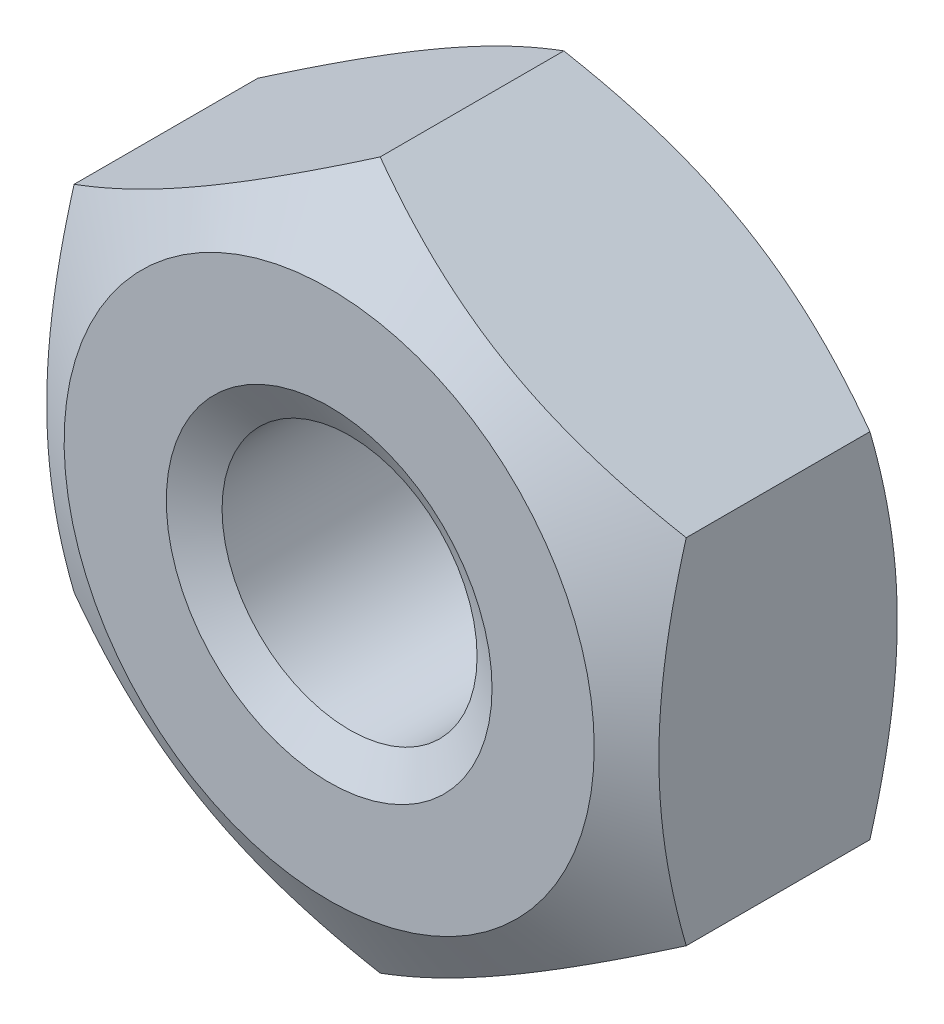
ISO-10303-21;
HEADER;
FILE_DESCRIPTION(('STEP AP214'),'2;1');
FILE_NAME('part.step','',(''),(''),'','','');
FILE_SCHEMA(('AUTOMOTIVE_DESIGN { 1 0 10303 214 1 1 1 1 }'));
ENDSEC;
DATA;
#1=APPLICATION_CONTEXT('core data for automotive mechanical design processes');
#2=APPLICATION_PROTOCOL_DEFINITION('international standard','automotive_design',2000,#1);
#3=PRODUCT_CONTEXT('',#1,'mechanical');
#4=PRODUCT('Part','Part','',(#3));
#5=PRODUCT_RELATED_PRODUCT_CATEGORY('part','',(#4));
#6=PRODUCT_DEFINITION_FORMATION('','',#4);
#7=PRODUCT_DEFINITION_CONTEXT('part definition',#1,'design');
#8=PRODUCT_DEFINITION('design','',#6,#7);
#9=PRODUCT_DEFINITION_SHAPE('','',#8);
#10=(LENGTH_UNIT() NAMED_UNIT(*) SI_UNIT(.MILLI.,.METRE.));
#11=(NAMED_UNIT(*) PLANE_ANGLE_UNIT() SI_UNIT($,.RADIAN.));
#12=(NAMED_UNIT(*) SI_UNIT($,.STERADIAN.) SOLID_ANGLE_UNIT());
#13=UNCERTAINTY_MEASURE_WITH_UNIT(LENGTH_MEASURE(1.E-05),#10,'distance_accuracy_value','');
#14=(GEOMETRIC_REPRESENTATION_CONTEXT(3) GLOBAL_UNCERTAINTY_ASSIGNED_CONTEXT((#13)) GLOBAL_UNIT_ASSIGNED_CONTEXT((#10,
#11,#12)) REPRESENTATION_CONTEXT('',''));
#15=CARTESIAN_POINT('',(0.,0.,0.));
#16=DIRECTION('',(0.,0.,1.));
#17=DIRECTION('',(1.,0.,0.));
#18=AXIS2_PLACEMENT_3D('',#15,#16,#17);
#19=CARTESIAN_POINT('',(1.49999999999999,0.866025403784457,-1.4));
#20=DIRECTION('',(0.499999999999995,0.866025403784442,0.));
#21=DIRECTION('',(-0.866025403784442,0.499999999999995,0.));
#22=AXIS2_PLACEMENT_3D('',#19,#20,#21);
#23=PLANE('',#22);
#24=CARTESIAN_POINT('',(-0.0002,1.73216627762272,-1.14993332666713));
#25=CARTESIAN_POINT('',(0.0657192911025475,1.69410775715987,-1.1719171434464));
#26=CARTESIAN_POINT('',(0.132207589122234,1.65572072040025,-1.19191111053375));
#27=CARTESIAN_POINT('',(0.266335660665069,1.57828184218911,-1.22681189903107));
#28=CARTESIAN_POINT('',(0.333977818646884,1.53922862406974,-1.24170637189241));
#29=CARTESIAN_POINT('',(0.46842377786984,1.46160621332091,-1.26489331890533));
#30=CARTESIAN_POINT('',(0.535206884927245,1.423048968484,-1.27334008850376));
#31=CARTESIAN_POINT('',(0.669087568389877,1.34575291984756,-1.28342642270372));
#32=CARTESIAN_POINT('',(0.736184657704374,1.30701439726999,-1.28507433685768));
#33=CARTESIAN_POINT('',(0.861574731829191,1.23462040422032,-1.28165837716247));
#34=CARTESIAN_POINT('',(0.919886423219814,1.20095413349904,-1.27743324099159));
#35=CARTESIAN_POINT('',(1.03612987953878,1.13384094270176,-1.2640382247829));
#36=CARTESIAN_POINT('',(1.09406124196878,1.10039425500828,-1.25486376259972));
#37=CARTESIAN_POINT('',(1.21054465133914,1.03314252725217,-1.23192681626058));
#38=CARTESIAN_POINT('',(1.26908194454668,0.999346005261166,-1.21806703805413));
#39=CARTESIAN_POINT('',(1.38528312338635,0.932257223377934,-1.18661021597892));
#40=CARTESIAN_POINT('',(1.4429484994038,0.898964103011338,-1.16902057032596));
#41=CARTESIAN_POINT('',(1.50019999999999,0.865909933730619,-1.14993332666712));
#42=B_SPLINE_CURVE_WITH_KNOTS('',3,(#24,#25,#26,#27,#28,#29,#30,#31,#32,#33,#34,#35,#36,#37,#38,
#39,#40,#41),.UNSPECIFIED.,.F.,.F.,(4,2,2,2,2,2,2,2,4),(0.,0.237777822177381,0.476127422841914,
0.708577067230583,0.940741159251571,1.14294352835889,1.34533342091874,1.55221450553905,
1.75868901573746),.UNSPECIFIED.);
#43=CARTESIAN_POINT('',(0.,1.73205080756891,-1.15));
#44=VERTEX_POINT('',#43);
#45=CARTESIAN_POINT('',(1.49999999999999,0.866025403784502,-1.15));
#46=VERTEX_POINT('',#45);
#47=EDGE_CURVE('E88',#44,#46,#42,.T.);
#48=ORIENTED_EDGE('',*,*,#47,.F.);
#49=DIRECTION('',(0.,0.,1.));
#50=VECTOR('',#49,1.);
#51=CARTESIAN_POINT('',(0.,1.73205080756888,-1.4));
#52=LINE('',#51,#50);
#53=CARTESIAN_POINT('',(0.,1.73205080756888,-0.249999999999983));
#54=VERTEX_POINT('',#53);
#55=EDGE_CURVE('E59',#44,#54,#52,.T.);
#56=ORIENTED_EDGE('',*,*,#55,.T.);
#57=CARTESIAN_POINT('',(1.50019999999999,0.865909933730619,-0.250066673332876));
#58=CARTESIAN_POINT('',(1.43428070889744,0.903968454193464,-0.228082856553604));
#59=CARTESIAN_POINT('',(1.36779241087776,0.94235549095309,-0.208088889466249));
#60=CARTESIAN_POINT('',(1.23366433933492,1.01979436916423,-0.173188100968934));
#61=CARTESIAN_POINT('',(1.16602218135311,1.0588475872836,-0.158293628107594));
#62=CARTESIAN_POINT('',(1.03157622213015,1.13646999803243,-0.13510668109467));
#63=CARTESIAN_POINT('',(0.964793115072744,1.17502724286934,-0.126659911496242));
#64=CARTESIAN_POINT('',(0.830912431610112,1.25232329150578,-0.11657357729628));
#65=CARTESIAN_POINT('',(0.763815342295614,1.29106181408335,-0.114925663142318));
#66=CARTESIAN_POINT('',(0.638425268170797,1.36345580713301,-0.118341622837532));
#67=CARTESIAN_POINT('',(0.580113576780174,1.39712207785429,-0.122566759008407));
#68=CARTESIAN_POINT('',(0.463870120461212,1.46423526865158,-0.135961775217097));
#69=CARTESIAN_POINT('',(0.40593875803121,1.49768195634506,-0.145136237400274));
#70=CARTESIAN_POINT('',(0.289455348660845,1.56493368410117,-0.168073183739419));
#71=CARTESIAN_POINT('',(0.230918055453306,1.59873020609217,-0.18193296194587));
#72=CARTESIAN_POINT('',(0.114716876613639,1.6658189879754,-0.213389784021079));
#73=CARTESIAN_POINT('',(0.0570515005961888,1.699112108342,-0.230979429674037));
#74=CARTESIAN_POINT('',(-0.000200000000000051,1.73216627762272,-0.250066673332872));
#75=B_SPLINE_CURVE_WITH_KNOTS('',3,(#57,#58,#59,#60,#61,#62,#63,#64,#65,#66,#67,#68,#69,#70,#71,
#72,#73,#74),.UNSPECIFIED.,.F.,.F.,(4,2,2,2,2,2,2,2,4),(0.,0.237777822177382,0.476127422841916,
0.708577067230586,0.940741159251575,1.1429435283589,1.34533342091874,1.55221450553906,
1.75868901573746),.UNSPECIFIED.);
#76=CARTESIAN_POINT('',(1.49999999999999,0.866025403784503,-0.250000000000001));
#77=VERTEX_POINT('',#76);
#78=EDGE_CURVE('E107',#77,#54,#75,.T.);
#79=ORIENTED_EDGE('',*,*,#78,.F.);
#80=DIRECTION('',(0.,0.,1.));
#81=VECTOR('',#80,1.);
#82=CARTESIAN_POINT('',(1.49999999999999,0.866025403784457,-1.4));
#83=LINE('',#82,#81);
#84=EDGE_CURVE('E102',#46,#77,#83,.T.);
#85=ORIENTED_EDGE('',*,*,#84,.F.);
#86=EDGE_LOOP('',(#48,#56,#79,#85));
#87=FACE_BOUND('',#86,.T.);
#88=ADVANCED_FACE('F36',(#87),#23,.T.);
#89=CARTESIAN_POINT('',(1.50000000000001,-0.866025403784425,-1.4));
#90=DIRECTION('',(1.,0.,0.));
#91=DIRECTION('',(0.,1.,0.));
#92=AXIS2_PLACEMENT_3D('',#89,#90,#91);
#93=PLANE('',#92);
#94=CARTESIAN_POINT('',(1.50000000000002,-2.2807732202783,-0.573936709991354));
#95=CARTESIAN_POINT('',(1.50000000000002,-2.2156210445045,-0.605355688611262));
#96=CARTESIAN_POINT('',(1.50000000000002,-2.15031443766187,-0.636459835310971));
#97=CARTESIAN_POINT('',(1.50000000000002,-2.01930971928559,-0.697860613483383));
#98=CARTESIAN_POINT('',(1.50000000000002,-1.95361154356196,-0.728157107839195));
#99=CARTESIAN_POINT('',(1.50000000000002,-1.82138019564906,-0.787927027536233));
#100=CARTESIAN_POINT('',(1.50000000000002,-1.75484439010186,-0.817394652365415));
#101=CARTESIAN_POINT('',(1.50000000000002,-1.62122834565648,-0.875060709663341));
#102=CARTESIAN_POINT('',(1.50000000000002,-1.5541481341152,-0.903259205446577));
#103=CARTESIAN_POINT('',(1.50000000000001,-1.41735947809199,-0.958855418055597));
#104=CARTESIAN_POINT('',(1.50000000000001,-1.34763149451046,-0.986205689933657));
#105=CARTESIAN_POINT('',(1.50000000000001,-1.20735758921427,-1.03871414886294));
#106=CARTESIAN_POINT('',(1.50000000000001,-1.13681156769636,-1.06387206518257));
#107=CARTESIAN_POINT('',(1.50000000000001,-0.924041890079284,-1.13503858358491));
#108=CARTESIAN_POINT('',(1.50000000000001,-0.780313873238381,-1.17689831926433));
#109=CARTESIAN_POINT('',(1.50000000000001,-0.562000170706209,-1.22598325326851));
#110=CARTESIAN_POINT('',(1.5,-0.488959664979743,-1.24004275995663));
#111=CARTESIAN_POINT('',(1.5,-0.342015881889071,-1.26268890937855));
#112=CARTESIAN_POINT('',(1.5,-0.268112672393984,-1.2712759797147));
#113=CARTESIAN_POINT('',(1.5,-0.120761318847337,-1.28218249719729));
#114=CARTESIAN_POINT('',(1.5,-0.0473190232916083,-1.28457890197161));
#115=CARTESIAN_POINT('',(1.5,0.099499947222512,-1.28310830408973));
#116=CARTESIAN_POINT('',(1.5,0.172876619612447,-1.27924106616445));
#117=CARTESIAN_POINT('',(1.5,0.351718709959219,-1.26252307145656));
#118=CARTESIAN_POINT('',(1.5,0.456882332290745,-1.24643200889295));
#119=CARTESIAN_POINT('',(1.49999999999999,0.665208255150202,-1.20432606342642));
#120=CARTESIAN_POINT('',(1.49999999999999,0.768368358943109,-1.17830086995822));
#121=CARTESIAN_POINT('',(1.49999999999999,0.974779816349307,-1.11848823761634));
#122=CARTESIAN_POINT('',(1.49999999999999,1.07798482551806,-1.08454499547237));
#123=CARTESIAN_POINT('',(1.49999999999999,1.28249024558448,-1.01153103776133));
#124=CARTESIAN_POINT('',(1.49999999999999,1.38379125789836,-0.972461973500144));
#125=CARTESIAN_POINT('',(1.49999999999998,1.61361087847929,-0.87913769567081));
#126=CARTESIAN_POINT('',(1.49999999999998,1.74165608940268,-0.823728333591492));
#127=CARTESIAN_POINT('',(1.49999999999998,1.99607108109679,-0.709167017777099));
#128=CARTESIAN_POINT('',(1.49999999999998,2.12244048864419,-0.650014246722006));
#129=CARTESIAN_POINT('',(1.49999999999998,2.37408263288399,-0.529156793090378));
#130=CARTESIAN_POINT('',(1.49999999999997,2.49935431836972,-0.467449932419216));
#131=CARTESIAN_POINT('',(1.49999999999997,2.7490285372206,-0.342300668721583));
#132=CARTESIAN_POINT('',(1.49999999999997,2.87343104481626,-0.278858214509837));
#133=CARTESIAN_POINT('',(1.49999999999997,3.11191628329182,-0.155724058607329));
#134=CARTESIAN_POINT('',(1.49999999999997,3.22604729837518,-0.0961256424446313));
#135=CARTESIAN_POINT('',(1.49999999999996,3.45389017740238,0.023873848457053));
#136=CARTESIAN_POINT('',(1.49999999999996,3.56760202928385,0.0842749460681989));
#137=CARTESIAN_POINT('',(1.49999999999996,3.79445292732096,0.205563584093104));
#138=CARTESIAN_POINT('',(1.49999999999996,3.90759267842518,0.266449807777674));
#139=CARTESIAN_POINT('',(1.49999999999996,4.13360183169341,0.388709427668254));
#140=CARTESIAN_POINT('',(1.49999999999996,4.24647124642338,0.45008280063484));
#141=CARTESIAN_POINT('',(1.49999999999995,4.3592399484054,0.511639402559556));
#142=B_SPLINE_CURVE_WITH_KNOTS('',3,(#94,#95,#96,#97,#98,#99,#100,#101,#102,#103,#104,#105,#106,
#107,#108,#109,#110,#111,#112,#113,#114,#115,#116,#117,#118,#119,#120,#121,#122,#123,#124,#125,
#126,#127,#128,#129,#130,#131,#132,#133,#134,#135,#136,#137,#138,#139,#140,#141),.UNSPECIFIED.,
.F.,.F.,(4,2,2,2,2,2,2,2,2,2,2,2,2,2,2,2,2,2,2,2,2,2,2,4),(0.,0.216999411713003,
0.434035432250143,0.65233165435681,0.870616973971527,1.0952779225467,1.31996657505736,
1.76813066937599,1.99111028787352,2.21407248117016,2.43424933896172,2.65443446702164,
2.97293806262893,3.29177313371924,3.61750854563506,3.94313927696458,4.36159863026302,
4.78014966554142,5.19906530242523,5.61799330711086,6.0042544493083,6.39052662159825,
6.77597262325083,7.16140034643672),.UNSPECIFIED.);
#143=CARTESIAN_POINT('',(1.50000000000002,-0.866025403784418,-1.15));
#144=VERTEX_POINT('',#143);
#145=EDGE_CURVE('E92',#46,#144,#142,.F.);
#146=ORIENTED_EDGE('',*,*,#145,.F.);
#147=ORIENTED_EDGE('',*,*,#84,.T.);
#148=CARTESIAN_POINT('',(1.50000000000002,-2.2807732202783,-0.826063290008646));
#149=CARTESIAN_POINT('',(1.50000000000002,-2.2156210445045,-0.794644311388738));
#150=CARTESIAN_POINT('',(1.50000000000002,-2.15031443766187,-0.763540164689029));
#151=CARTESIAN_POINT('',(1.50000000000002,-2.01930971928559,-0.702139386516617));
#152=CARTESIAN_POINT('',(1.50000000000002,-1.95361154356196,-0.671842892160805));
#153=CARTESIAN_POINT('',(1.50000000000002,-1.82138019564906,-0.612072972463766));
#154=CARTESIAN_POINT('',(1.50000000000002,-1.75484439010186,-0.582605347634585));
#155=CARTESIAN_POINT('',(1.50000000000002,-1.62122834565648,-0.524939290336658));
#156=CARTESIAN_POINT('',(1.50000000000002,-1.5541481341152,-0.496740794553423));
#157=CARTESIAN_POINT('',(1.50000000000001,-1.41735947809199,-0.441144581944403));
#158=CARTESIAN_POINT('',(1.50000000000001,-1.34763149451046,-0.413794310066342));
#159=CARTESIAN_POINT('',(1.50000000000001,-1.20735758921427,-0.361285851137064));
#160=CARTESIAN_POINT('',(1.50000000000001,-1.13681156769636,-0.336127934817426));
#161=CARTESIAN_POINT('',(1.50000000000001,-0.924041890079284,-0.26496141641509));
#162=CARTESIAN_POINT('',(1.50000000000001,-0.780313873238381,-0.223101680735669));
#163=CARTESIAN_POINT('',(1.50000000000001,-0.562000170706209,-0.174016746731492));
#164=CARTESIAN_POINT('',(1.5,-0.488959664979743,-0.159957240043373));
#165=CARTESIAN_POINT('',(1.5,-0.342015881889071,-0.137311090621454));
#166=CARTESIAN_POINT('',(1.5,-0.268112672393984,-0.128724020285304));
#167=CARTESIAN_POINT('',(1.5,-0.120761318847337,-0.117817502802706));
#168=CARTESIAN_POINT('',(1.5,-0.0473190232916082,-0.115421098028387));
#169=CARTESIAN_POINT('',(1.5,0.0994999472225122,-0.116891695910272));
#170=CARTESIAN_POINT('',(1.5,0.172876619612447,-0.120758933835546));
#171=CARTESIAN_POINT('',(1.5,0.351718709959219,-0.137476928543443));
#172=CARTESIAN_POINT('',(1.5,0.456882332290745,-0.153567991107053));
#173=CARTESIAN_POINT('',(1.49999999999999,0.665208255150202,-0.195673936573582));
#174=CARTESIAN_POINT('',(1.49999999999999,0.768368358943109,-0.221699130041783));
#175=CARTESIAN_POINT('',(1.49999999999999,0.974779816349306,-0.281511762383655));
#176=CARTESIAN_POINT('',(1.49999999999999,1.07798482551806,-0.315455004527625));
#177=CARTESIAN_POINT('',(1.49999999999999,1.28249024558448,-0.388468962238671));
#178=CARTESIAN_POINT('',(1.49999999999999,1.38379125789836,-0.427538026499856));
#179=CARTESIAN_POINT('',(1.49999999999998,1.61361087847929,-0.520862304329189));
#180=CARTESIAN_POINT('',(1.49999999999998,1.74165608940267,-0.576271666408507));
#181=CARTESIAN_POINT('',(1.49999999999998,1.99607108109679,-0.6908329822229));
#182=CARTESIAN_POINT('',(1.49999999999998,2.12244048864419,-0.749985753277993));
#183=CARTESIAN_POINT('',(1.49999999999998,2.37408263288399,-0.870843206909622));
#184=CARTESIAN_POINT('',(1.49999999999997,2.49935431836972,-0.932550067580784));
#185=CARTESIAN_POINT('',(1.49999999999997,2.7490285372206,-1.05769933127842));
#186=CARTESIAN_POINT('',(1.49999999999997,2.87343104481626,-1.12114178549016));
#187=CARTESIAN_POINT('',(1.49999999999997,3.11191628329182,-1.24427594139267));
#188=CARTESIAN_POINT('',(1.49999999999997,3.22604729837518,-1.30387435755537));
#189=CARTESIAN_POINT('',(1.49999999999996,3.45389017740238,-1.42387384845705));
#190=CARTESIAN_POINT('',(1.49999999999996,3.56760202928385,-1.4842749460682));
#191=CARTESIAN_POINT('',(1.49999999999996,3.79445292732096,-1.6055635840931));
#192=CARTESIAN_POINT('',(1.49999999999996,3.90759267842518,-1.66644980777767));
#193=CARTESIAN_POINT('',(1.49999999999996,4.13360183169341,-1.78870942766825));
#194=CARTESIAN_POINT('',(1.49999999999996,4.24647124642338,-1.85008280063484));
#195=CARTESIAN_POINT('',(1.49999999999995,4.3592399484054,-1.91163940255956));
#196=B_SPLINE_CURVE_WITH_KNOTS('',3,(#148,#149,#150,#151,#152,#153,#154,#155,#156,#157,#158,
#159,#160,#161,#162,#163,#164,#165,#166,#167,#168,#169,#170,#171,#172,#173,#174,#175,#176,#177,
#178,#179,#180,#181,#182,#183,#184,#185,#186,#187,#188,#189,#190,#191,#192,#193,#194,#195),
.UNSPECIFIED.,.F.,.F.,(4,2,2,2,2,2,2,2,2,2,2,2,2,2,2,2,2,2,2,2,2,2,2,4),(0.,0.216999411713004,
0.434035432250143,0.652331654356811,0.870616973971527,1.0952779225467,1.31996657505736,
1.76813066937599,1.99111028787352,2.21407248117016,2.43424933896172,2.65443446702164,
2.97293806262893,3.29177313371924,3.61750854563506,3.94313927696458,4.36159863026302,
4.78014966554141,5.19906530242523,5.61799330711086,6.0042544493083,6.39052662159825,
6.77597262325082,7.16140034643672),.UNSPECIFIED.);
#197=CARTESIAN_POINT('',(1.50000000000002,-0.866025403784418,-0.250000000000001));
#198=VERTEX_POINT('',#197);
#199=EDGE_CURVE('E124',#198,#77,#196,.T.);
#200=ORIENTED_EDGE('',*,*,#199,.F.);
#201=DIRECTION('',(0.,0.,1.));
#202=VECTOR('',#201,1.);
#203=CARTESIAN_POINT('',(1.50000000000001,-0.866025403784425,-1.4));
#204=LINE('',#203,#202);
#205=EDGE_CURVE('E104',#144,#198,#204,.T.);
#206=ORIENTED_EDGE('',*,*,#205,.F.);
#207=EDGE_LOOP('',(#146,#147,#200,#206));
#208=FACE_BOUND('',#207,.T.);
#209=ADVANCED_FACE('F100',(#208),#93,.T.);
#210=CARTESIAN_POINT('',(0.,-1.73205080756888,-1.4));
#211=DIRECTION('',(0.500000000000007,-0.866025403784435,0.));
#212=DIRECTION('',(0.866025403784435,0.500000000000007,0.));
#213=AXIS2_PLACEMENT_3D('',#210,#211,#212);
#214=PLANE('',#213);
#215=CARTESIAN_POINT('',(1.50020000000001,-0.865909933730588,-1.14993332666711));
#216=CARTESIAN_POINT('',(1.43428070889746,-0.903968454193433,-1.17191714344639));
#217=CARTESIAN_POINT('',(1.36779241087777,-0.942355490953061,-1.19191111053374));
#218=CARTESIAN_POINT('',(1.23366433933494,-1.0197943691642,-1.22681189903106));
#219=CARTESIAN_POINT('',(1.16602218135312,-1.05884758728357,-1.2417063718924));
#220=CARTESIAN_POINT('',(1.03157622213017,-1.13646999803241,-1.26489331890532));
#221=CARTESIAN_POINT('',(0.964793115072761,-1.17502724286932,-1.27334008850375));
#222=CARTESIAN_POINT('',(0.830912431610128,-1.25232329150576,-1.28342642270371));
#223=CARTESIAN_POINT('',(0.76381534229563,-1.29106181408333,-1.28507433685767));
#224=CARTESIAN_POINT('',(0.638425268170814,-1.363455807133,-1.28165837716246));
#225=CARTESIAN_POINT('',(0.58011357678019,-1.39712207785428,-1.27743324099158));
#226=CARTESIAN_POINT('',(0.463870120461227,-1.46423526865157,-1.26403822478289));
#227=CARTESIAN_POINT('',(0.405938758031224,-1.49768195634505,-1.25486376259971));
#228=CARTESIAN_POINT('',(0.289455348660859,-1.56493368410116,-1.23192681626056));
#229=CARTESIAN_POINT('',(0.230918055453319,-1.59873020609216,-1.21806703805411));
#230=CARTESIAN_POINT('',(0.114716876613652,-1.6658189879754,-1.1866102159789));
#231=CARTESIAN_POINT('',(0.0570515005962014,-1.699112108342,-1.16902057032594));
#232=CARTESIAN_POINT('',(-0.000199999999987768,-1.73216627762272,-1.14993332666711));
#233=B_SPLINE_CURVE_WITH_KNOTS('',3,(#215,#216,#217,#218,#219,#220,#221,#222,#223,#224,#225,
#226,#227,#228,#229,#230,#231,#232),.UNSPECIFIED.,.F.,.F.,(4,2,2,2,2,2,2,2,4),(0.,
0.237777822177385,0.476127422841921,0.708577067230593,0.940741159251584,1.14294352835891,
1.34533342091876,1.55221450553907,1.75868901573748),.UNSPECIFIED.);
#234=CARTESIAN_POINT('',(0.,-1.73205080756888,-1.15));
#235=VERTEX_POINT('',#234);
#236=EDGE_CURVE('E105',#144,#235,#233,.T.);
#237=ORIENTED_EDGE('',*,*,#236,.F.);
#238=ORIENTED_EDGE('',*,*,#205,.T.);
#239=CARTESIAN_POINT('',(-0.000199999999987872,-1.73216627762272,-0.25006667333289));
#240=CARTESIAN_POINT('',(0.0657192911025599,-1.69410775715987,-0.228082856553617));
#241=CARTESIAN_POINT('',(0.132207589122248,-1.65572072040024,-0.208088889466262));
#242=CARTESIAN_POINT('',(0.266335660665083,-1.5782818421891,-0.173188100968946));
#243=CARTESIAN_POINT('',(0.333977818646899,-1.53922862406973,-0.158293628107606));
#244=CARTESIAN_POINT('',(0.468423777869857,-1.4616062133209,-0.135106681094683));
#245=CARTESIAN_POINT('',(0.535206884927262,-1.42304896848398,-0.126659911496254));
#246=CARTESIAN_POINT('',(0.669087568389895,-1.34575291984754,-0.116573577296292));
#247=CARTESIAN_POINT('',(0.736184657704393,-1.30701439726997,-0.11492566314233));
#248=CARTESIAN_POINT('',(0.86157473182921,-1.2346204042203,-0.118341622837544));
#249=CARTESIAN_POINT('',(0.919886423219833,-1.20095413349902,-0.122566759008419));
#250=CARTESIAN_POINT('',(1.0361298795388,-1.13384094270174,-0.13596177521711));
#251=CARTESIAN_POINT('',(1.0940612419688,-1.10039425500825,-0.145136237400286));
#252=CARTESIAN_POINT('',(1.21054465133916,-1.03314252725214,-0.168073183739432));
#253=CARTESIAN_POINT('',(1.2690819445467,-0.999346005261139,-0.181932961945883));
#254=CARTESIAN_POINT('',(1.38528312338637,-0.932257223377904,-0.213389784021092));
#255=CARTESIAN_POINT('',(1.44294849940382,-0.898964103011308,-0.23097942967405));
#256=CARTESIAN_POINT('',(1.50020000000001,-0.865909933730588,-0.250066673332885));
#257=B_SPLINE_CURVE_WITH_KNOTS('',3,(#239,#240,#241,#242,#243,#244,#245,#246,#247,#248,#249,
#250,#251,#252,#253,#254,#255,#256),.UNSPECIFIED.,.F.,.F.,(4,2,2,2,2,2,2,2,4),(0.,
0.237777822177385,0.476127422841923,0.708577067230596,0.940741159251588,1.14294352835891,
1.34533342091876,1.55221450553907,1.75868901573748),.UNSPECIFIED.);
#258=CARTESIAN_POINT('',(0.,-1.73205080756888,-0.250000000000001));
#259=VERTEX_POINT('',#258);
#260=EDGE_CURVE('E128',#259,#198,#257,.T.);
#261=ORIENTED_EDGE('',*,*,#260,.F.);
#262=DIRECTION('',(0.,0.,1.));
#263=VECTOR('',#262,1.);
#264=CARTESIAN_POINT('',(0.,-1.73205080756888,-1.4));
#265=LINE('',#264,#263);
#266=EDGE_CURVE('E110',#235,#259,#265,.T.);
#267=ORIENTED_EDGE('',*,*,#266,.F.);
#268=EDGE_LOOP('',(#237,#238,#261,#267));
#269=FACE_BOUND('',#268,.T.);
#270=ADVANCED_FACE('F180',(#269),#214,.T.);
#271=CARTESIAN_POINT('',(-1.5,-0.866025403784446,-1.4));
#272=DIRECTION('',(-0.499999999999995,-0.866025403784442,0.));
#273=DIRECTION('',(0.866025403784441,-0.499999999999995,0.));
#274=AXIS2_PLACEMENT_3D('',#271,#272,#273);
#275=PLANE('',#274);
#276=CARTESIAN_POINT('',(0.000200000000012162,-1.73216627762272,-1.14993332666711));
#277=CARTESIAN_POINT('',(-0.0657192911025362,-1.69410775715987,-1.17191714344638));
#278=CARTESIAN_POINT('',(-0.132207589122224,-1.65572072040024,-1.19191111053374));
#279=CARTESIAN_POINT('',(-0.266335660665061,-1.5782818421891,-1.22681189903105));
#280=CARTESIAN_POINT('',(-0.333977818646878,-1.53922862406974,-1.24170637189239));
#281=CARTESIAN_POINT('',(-0.468423777869836,-1.4616062133209,-1.26489331890532));
#282=CARTESIAN_POINT('',(-0.535206884927242,-1.42304896848399,-1.27334008850375));
#283=CARTESIAN_POINT('',(-0.669087568389876,-1.34575291984755,-1.28342642270371));
#284=CARTESIAN_POINT('',(-0.736184657704375,-1.30701439726998,-1.28507433685767));
#285=CARTESIAN_POINT('',(-0.861574731829193,-1.23462040422031,-1.28165837716246));
#286=CARTESIAN_POINT('',(-0.919886423219817,-1.20095413349904,-1.27743324099158));
#287=CARTESIAN_POINT('',(-1.03612987953878,-1.13384094270175,-1.26403822478289));
#288=CARTESIAN_POINT('',(-1.09406124196878,-1.10039425500827,-1.25486376259971));
#289=CARTESIAN_POINT('',(-1.21054465133915,-1.03314252725216,-1.23192681626057));
#290=CARTESIAN_POINT('',(-1.26908194454669,-0.999346005261157,-1.21806703805412));
#291=CARTESIAN_POINT('',(-1.38528312338636,-0.932257223377923,-1.18661021597891));
#292=CARTESIAN_POINT('',(-1.44294849940381,-0.898964103011328,-1.16902057032595));
#293=CARTESIAN_POINT('',(-1.5002,-0.865909933730608,-1.14993332666711));
#294=B_SPLINE_CURVE_WITH_KNOTS('',3,(#276,#277,#278,#279,#280,#281,#282,#283,#284,#285,#286,
#287,#288,#289,#290,#291,#292,#293),.UNSPECIFIED.,.F.,.F.,(4,2,2,2,2,2,2,2,4),(0.,
0.237777822177385,0.476127422841922,0.708577067230595,0.940741159251588,1.14294352835891,
1.34533342091876,1.55221450553907,1.75868901573748),.UNSPECIFIED.);
#295=CARTESIAN_POINT('',(-1.5,-0.86602540378446,-1.15));
#296=VERTEX_POINT('',#295);
#297=EDGE_CURVE('E186',#235,#296,#294,.T.);
#298=ORIENTED_EDGE('',*,*,#297,.F.);
#299=ORIENTED_EDGE('',*,*,#266,.T.);
#300=CARTESIAN_POINT('',(-1.5002,-0.865909933730608,-0.250066673332885));
#301=CARTESIAN_POINT('',(-1.43428070889745,-0.903968454193453,-0.228082856553613));
#302=CARTESIAN_POINT('',(-1.36779241087776,-0.94235549095308,-0.208088889466258));
#303=CARTESIAN_POINT('',(-1.23366433933492,-1.01979436916422,-0.173188100968943));
#304=CARTESIAN_POINT('',(-1.16602218135311,-1.05884758728359,-0.158293628107604));
#305=CARTESIAN_POINT('',(-1.03157622213015,-1.13646999803242,-0.135106681094681));
#306=CARTESIAN_POINT('',(-0.964793115072745,-1.17502724286933,-0.126659911496253));
#307=CARTESIAN_POINT('',(-0.830912431610111,-1.25232329150577,-0.116573577296292));
#308=CARTESIAN_POINT('',(-0.763815342295612,-1.29106181408334,-0.11492566314233));
#309=CARTESIAN_POINT('',(-0.638425268170795,-1.36345580713301,-0.118341622837544));
#310=CARTESIAN_POINT('',(-0.58011357678017,-1.39712207785429,-0.12256675900842));
#311=CARTESIAN_POINT('',(-0.463870120461207,-1.46423526865157,-0.135961775217111));
#312=CARTESIAN_POINT('',(-0.405938758031203,-1.49768195634506,-0.145136237400288));
#313=CARTESIAN_POINT('',(-0.289455348660837,-1.56493368410116,-0.168073183739435));
#314=CARTESIAN_POINT('',(-0.230918055453297,-1.59873020609217,-0.181932961945886));
#315=CARTESIAN_POINT('',(-0.114716876613628,-1.6658189879754,-0.213389784021096));
#316=CARTESIAN_POINT('',(-0.0570515005961773,-1.699112108342,-0.230979429674055));
#317=CARTESIAN_POINT('',(0.000200000000012196,-1.73216627762272,-0.25006667333289));
#318=B_SPLINE_CURVE_WITH_KNOTS('',3,(#300,#301,#302,#303,#304,#305,#306,#307,#308,#309,#310,
#311,#312,#313,#314,#315,#316,#317),.UNSPECIFIED.,.F.,.F.,(4,2,2,2,2,2,2,2,4),(0.,
0.237777822177384,0.476127422841921,0.708577067230593,0.940741159251584,1.14294352835891,
1.34533342091876,1.55221450553907,1.75868901573748),.UNSPECIFIED.);
#319=CARTESIAN_POINT('',(-1.5,-0.866025403784461,-0.250000000000001));
#320=VERTEX_POINT('',#319);
#321=EDGE_CURVE('E130',#320,#259,#318,.T.);
#322=ORIENTED_EDGE('',*,*,#321,.F.);
#323=DIRECTION('',(0.,0.,1.));
#324=VECTOR('',#323,1.);
#325=CARTESIAN_POINT('',(-1.5,-0.866025403784446,-1.4));
#326=LINE('',#325,#324);
#327=EDGE_CURVE('E120',#296,#320,#326,.T.);
#328=ORIENTED_EDGE('',*,*,#327,.F.);
#329=EDGE_LOOP('',(#298,#299,#322,#328));
#330=FACE_BOUND('',#329,.T.);
#331=ADVANCED_FACE('F176',(#330),#275,.T.);
#332=CARTESIAN_POINT('',(-1.5,0.866025403784436,-1.4));
#333=DIRECTION('',(-1.,0.,0.));
#334=DIRECTION('',(0.,-1.,0.));
#335=AXIS2_PLACEMENT_3D('',#332,#333,#334);
#336=PLANE('',#335);
#337=CARTESIAN_POINT('',(-1.49999999999999,-2.28077322027832,-0.573936709991354));
#338=CARTESIAN_POINT('',(-1.49999999999999,-2.21562104450452,-0.605355688611263));
#339=CARTESIAN_POINT('',(-1.49999999999999,-2.15031443766189,-0.636459835310972));
#340=CARTESIAN_POINT('',(-1.49999999999999,-2.01930971928561,-0.697860613483383));
#341=CARTESIAN_POINT('',(-1.49999999999999,-1.95361154356198,-0.728157107839195));
#342=CARTESIAN_POINT('',(-1.49999999999999,-1.82138019564908,-0.787927027536233));
#343=CARTESIAN_POINT('',(-1.49999999999999,-1.75484439010188,-0.817394652365415));
#344=CARTESIAN_POINT('',(-1.49999999999999,-1.6212283456565,-0.875060709663341));
#345=CARTESIAN_POINT('',(-1.49999999999999,-1.55414813411522,-0.903259205446577));
#346=CARTESIAN_POINT('',(-1.5,-1.41735947809201,-0.958855418055597));
#347=CARTESIAN_POINT('',(-1.5,-1.34763149451048,-0.986205689933657));
#348=CARTESIAN_POINT('',(-1.5,-1.2073575892143,-1.03871414886293));
#349=CARTESIAN_POINT('',(-1.5,-1.13681156769638,-1.06387206518257));
#350=CARTESIAN_POINT('',(-1.5,-0.924041890079305,-1.13503858358491));
#351=CARTESIAN_POINT('',(-1.5,-0.780313873238402,-1.17689831926433));
#352=CARTESIAN_POINT('',(-1.5,-0.56200017070623,-1.22598325326851));
#353=CARTESIAN_POINT('',(-1.5,-0.488959664979764,-1.24004275995663));
#354=CARTESIAN_POINT('',(-1.5,-0.342015881889092,-1.26268890937855));
#355=CARTESIAN_POINT('',(-1.5,-0.268112672394005,-1.2712759797147));
#356=CARTESIAN_POINT('',(-1.5,-0.120761318847358,-1.28218249719729));
#357=CARTESIAN_POINT('',(-1.5,-0.047319023291629,-1.28457890197161));
#358=CARTESIAN_POINT('',(-1.5,0.0994999472224914,-1.28310830408973));
#359=CARTESIAN_POINT('',(-1.5,0.172876619612426,-1.27924106616445));
#360=CARTESIAN_POINT('',(-1.5,0.351718709959198,-1.26252307145656));
#361=CARTESIAN_POINT('',(-1.5,0.456882332290724,-1.24643200889295));
#362=CARTESIAN_POINT('',(-1.5,0.665208255150181,-1.20432606342642));
#363=CARTESIAN_POINT('',(-1.5,0.768368358943088,-1.17830086995822));
#364=CARTESIAN_POINT('',(-1.5,0.974779816349286,-1.11848823761634));
#365=CARTESIAN_POINT('',(-1.5,1.07798482551804,-1.08454499547237));
#366=CARTESIAN_POINT('',(-1.5,1.28249024558446,-1.01153103776133));
#367=CARTESIAN_POINT('',(-1.50000000000001,1.38379125789834,-0.972461973500144));
#368=CARTESIAN_POINT('',(-1.50000000000001,1.61361087847927,-0.87913769567081));
#369=CARTESIAN_POINT('',(-1.50000000000001,1.74165608940265,-0.823728333591492));
#370=CARTESIAN_POINT('',(-1.50000000000001,1.99607108109677,-0.709167017777099));
#371=CARTESIAN_POINT('',(-1.50000000000001,2.12244048864417,-0.650014246722006));
#372=CARTESIAN_POINT('',(-1.50000000000001,2.37408263288397,-0.529156793090377));
#373=CARTESIAN_POINT('',(-1.50000000000001,2.4993543183697,-0.467449932419215));
#374=CARTESIAN_POINT('',(-1.50000000000001,2.74902853722058,-0.342300668721583));
#375=CARTESIAN_POINT('',(-1.50000000000001,2.87343104481624,-0.278858214509837));
#376=CARTESIAN_POINT('',(-1.50000000000001,3.1119162832918,-0.155724058607329));
#377=CARTESIAN_POINT('',(-1.50000000000001,3.22604729837516,-0.0961256424446309));
#378=CARTESIAN_POINT('',(-1.50000000000001,3.45389017740235,0.0238738484570534));
#379=CARTESIAN_POINT('',(-1.50000000000001,3.56760202928383,0.0842749460681992));
#380=CARTESIAN_POINT('',(-1.50000000000001,3.79445292732094,0.205563584093104));
#381=CARTESIAN_POINT('',(-1.50000000000001,3.90759267842516,0.266449807777674));
#382=CARTESIAN_POINT('',(-1.50000000000002,4.13360183169339,0.388709427668254));
#383=CARTESIAN_POINT('',(-1.50000000000002,4.24647124642336,0.450082800634841));
#384=CARTESIAN_POINT('',(-1.50000000000002,4.35923994840538,0.511639402559557));
#385=B_SPLINE_CURVE_WITH_KNOTS('',3,(#337,#338,#339,#340,#341,#342,#343,#344,#345,#346,#347,
#348,#349,#350,#351,#352,#353,#354,#355,#356,#357,#358,#359,#360,#361,#362,#363,#364,#365,#366,
#367,#368,#369,#370,#371,#372,#373,#374,#375,#376,#377,#378,#379,#380,#381,#382,#383,#384),
.UNSPECIFIED.,.F.,.F.,(4,2,2,2,2,2,2,2,2,2,2,2,2,2,2,2,2,2,2,2,2,2,2,4),(0.,0.216999411713004,
0.434035432250143,0.65233165435681,0.870616973971527,1.0952779225467,1.31996657505736,
1.76813066937599,1.99111028787352,2.21407248117016,2.43424933896172,2.65443446702164,
2.97293806262893,3.29177313371924,3.61750854563506,3.94313927696458,4.36159863026302,
4.78014966554142,5.19906530242523,5.61799330711086,6.0042544493083,6.39052662159825,
6.77597262325082,7.16140034643672),.UNSPECIFIED.);
#386=CARTESIAN_POINT('',(-1.5,0.866025403784436,-1.15000000000001));
#387=VERTEX_POINT('',#386);
#388=EDGE_CURVE('E51',#296,#387,#385,.T.);
#389=ORIENTED_EDGE('',*,*,#388,.F.);
#390=ORIENTED_EDGE('',*,*,#327,.T.);
#391=CARTESIAN_POINT('',(-1.49999999999999,-2.28077322027832,-0.826063290008646));
#392=CARTESIAN_POINT('',(-1.49999999999999,-2.21562104450452,-0.794644311388738));
#393=CARTESIAN_POINT('',(-1.49999999999999,-2.15031443766189,-0.763540164689029));
#394=CARTESIAN_POINT('',(-1.49999999999999,-2.01930971928561,-0.702139386516617));
#395=CARTESIAN_POINT('',(-1.49999999999999,-1.95361154356198,-0.671842892160805));
#396=CARTESIAN_POINT('',(-1.49999999999999,-1.82138019564908,-0.612072972463767));
#397=CARTESIAN_POINT('',(-1.49999999999999,-1.75484439010188,-0.582605347634585));
#398=CARTESIAN_POINT('',(-1.49999999999999,-1.6212283456565,-0.524939290336658));
#399=CARTESIAN_POINT('',(-1.49999999999999,-1.55414813411522,-0.496740794553423));
#400=CARTESIAN_POINT('',(-1.5,-1.41735947809201,-0.441144581944403));
#401=CARTESIAN_POINT('',(-1.5,-1.34763149451048,-0.413794310066343));
#402=CARTESIAN_POINT('',(-1.5,-1.2073575892143,-0.361285851137065));
#403=CARTESIAN_POINT('',(-1.5,-1.13681156769638,-0.336127934817426));
#404=CARTESIAN_POINT('',(-1.5,-0.924041890079305,-0.264961416415091));
#405=CARTESIAN_POINT('',(-1.5,-0.780313873238402,-0.223101680735669));
#406=CARTESIAN_POINT('',(-1.5,-0.562000170706229,-0.174016746731492));
#407=CARTESIAN_POINT('',(-1.5,-0.488959664979764,-0.159957240043373));
#408=CARTESIAN_POINT('',(-1.5,-0.342015881889091,-0.137311090621454));
#409=CARTESIAN_POINT('',(-1.5,-0.268112672394004,-0.128724020285304));
#410=CARTESIAN_POINT('',(-1.5,-0.120761318847358,-0.117817502802706));
#411=CARTESIAN_POINT('',(-1.5,-0.0473190232916288,-0.115421098028387));
#412=CARTESIAN_POINT('',(-1.5,0.0994999472224915,-0.116891695910272));
#413=CARTESIAN_POINT('',(-1.5,0.172876619612427,-0.120758933835546));
#414=CARTESIAN_POINT('',(-1.5,0.351718709959199,-0.137476928543443));
#415=CARTESIAN_POINT('',(-1.5,0.456882332290724,-0.153567991107053));
#416=CARTESIAN_POINT('',(-1.5,0.665208255150181,-0.195673936573583));
#417=CARTESIAN_POINT('',(-1.5,0.768368358943088,-0.221699130041783));
#418=CARTESIAN_POINT('',(-1.5,0.974779816349286,-0.281511762383655));
#419=CARTESIAN_POINT('',(-1.5,1.07798482551804,-0.315455004527625));
#420=CARTESIAN_POINT('',(-1.5,1.28249024558446,-0.388468962238671));
#421=CARTESIAN_POINT('',(-1.50000000000001,1.38379125789834,-0.427538026499856));
#422=CARTESIAN_POINT('',(-1.50000000000001,1.61361087847927,-0.52086230432919));
#423=CARTESIAN_POINT('',(-1.50000000000001,1.74165608940265,-0.576271666408507));
#424=CARTESIAN_POINT('',(-1.50000000000001,1.99607108109677,-0.6908329822229));
#425=CARTESIAN_POINT('',(-1.50000000000001,2.12244048864417,-0.749985753277993));
#426=CARTESIAN_POINT('',(-1.50000000000001,2.37408263288397,-0.870843206909622));
#427=CARTESIAN_POINT('',(-1.50000000000001,2.4993543183697,-0.932550067580785));
#428=CARTESIAN_POINT('',(-1.50000000000001,2.74902853722058,-1.05769933127842));
#429=CARTESIAN_POINT('',(-1.50000000000001,2.87343104481624,-1.12114178549016));
#430=CARTESIAN_POINT('',(-1.50000000000001,3.1119162832918,-1.24427594139267));
#431=CARTESIAN_POINT('',(-1.50000000000001,3.22604729837516,-1.30387435755537));
#432=CARTESIAN_POINT('',(-1.50000000000001,3.45389017740235,-1.42387384845705));
#433=CARTESIAN_POINT('',(-1.50000000000001,3.56760202928383,-1.4842749460682));
#434=CARTESIAN_POINT('',(-1.50000000000001,3.79445292732094,-1.6055635840931));
#435=CARTESIAN_POINT('',(-1.50000000000001,3.90759267842516,-1.66644980777767));
#436=CARTESIAN_POINT('',(-1.50000000000002,4.13360183169339,-1.78870942766825));
#437=CARTESIAN_POINT('',(-1.50000000000002,4.24647124642336,-1.85008280063484));
#438=CARTESIAN_POINT('',(-1.50000000000002,4.35923994840538,-1.91163940255956));
#439=B_SPLINE_CURVE_WITH_KNOTS('',3,(#391,#392,#393,#394,#395,#396,#397,#398,#399,#400,#401,
#402,#403,#404,#405,#406,#407,#408,#409,#410,#411,#412,#413,#414,#415,#416,#417,#418,#419,#420,
#421,#422,#423,#424,#425,#426,#427,#428,#429,#430,#431,#432,#433,#434,#435,#436,#437,#438),
.UNSPECIFIED.,.F.,.F.,(4,2,2,2,2,2,2,2,2,2,2,2,2,2,2,2,2,2,2,2,2,2,2,4),(0.,0.216999411713004,
0.434035432250143,0.652331654356811,0.870616973971527,1.0952779225467,1.31996657505736,
1.76813066937599,1.99111028787352,2.21407248117016,2.43424933896172,2.65443446702164,
2.97293806262893,3.29177313371924,3.61750854563506,3.94313927696458,4.36159863026302,
4.78014966554141,5.19906530242524,5.61799330711086,6.0042544493083,6.39052662159825,
6.77597262325082,7.16140034643672),.UNSPECIFIED.);
#440=CARTESIAN_POINT('',(-1.50000000000004,0.866025403784413,-0.250000000000001));
#441=VERTEX_POINT('',#440);
#442=EDGE_CURVE('E165',#441,#320,#439,.F.);
#443=ORIENTED_EDGE('',*,*,#442,.F.);
#444=DIRECTION('',(0.,0.,1.));
#445=VECTOR('',#444,1.);
#446=CARTESIAN_POINT('',(-1.5,0.866025403784436,-1.4));
#447=LINE('',#446,#445);
#448=EDGE_CURVE('E122',#387,#441,#447,.T.);
#449=ORIENTED_EDGE('',*,*,#448,.F.);
#450=EDGE_LOOP('',(#389,#390,#443,#449));
#451=FACE_BOUND('',#450,.T.);
#452=ADVANCED_FACE('F179',(#451),#336,.T.);
#453=CARTESIAN_POINT('',(0.,1.73205080756888,-1.4));
#454=DIRECTION('',(-0.500000000000001,0.866025403784438,0.));
#455=DIRECTION('',(-0.866025403784438,-0.500000000000001,0.));
#456=AXIS2_PLACEMENT_3D('',#453,#454,#455);
#457=PLANE('',#456);
#458=CARTESIAN_POINT('',(-1.5002,0.865909933730598,-1.14993332666712));
#459=CARTESIAN_POINT('',(-1.43428070889746,0.903968454193443,-1.1719171434464));
#460=CARTESIAN_POINT('',(-1.36779241087777,0.942355490953069,-1.19191111053375));
#461=CARTESIAN_POINT('',(-1.23366433933493,1.01979436916421,-1.22681189903107));
#462=CARTESIAN_POINT('',(-1.16602218135312,1.05884758728358,-1.24170637189241));
#463=CARTESIAN_POINT('',(-1.03157622213016,1.13646999803241,-1.26489331890533));
#464=CARTESIAN_POINT('',(-0.964793115072759,1.17502724286932,-1.27334008850376));
#465=CARTESIAN_POINT('',(-0.830912431610127,1.25232329150576,-1.28342642270372));
#466=CARTESIAN_POINT('',(-0.76381534229563,1.29106181408333,-1.28507433685768));
#467=CARTESIAN_POINT('',(-0.638425268170812,1.363455807133,-1.28165837716247));
#468=CARTESIAN_POINT('',(-0.580113576780188,1.39712207785428,-1.2774332409916));
#469=CARTESIAN_POINT('',(-0.463870120461223,1.46423526865157,-1.26403822478291));
#470=CARTESIAN_POINT('',(-0.405938758031219,1.49768195634505,-1.25486376259973));
#471=CARTESIAN_POINT('',(-0.289455348660851,1.56493368410116,-1.23192681626058));
#472=CARTESIAN_POINT('',(-0.230918055453311,1.59873020609216,-1.21806703805413));
#473=CARTESIAN_POINT('',(-0.114716876613642,1.6658189879754,-1.18661021597892));
#474=CARTESIAN_POINT('',(-0.0570515005961903,1.699112108342,-1.16902057032596));
#475=CARTESIAN_POINT('',(0.000199999999999861,1.73216627762272,-1.14993332666713));
#476=B_SPLINE_CURVE_WITH_KNOTS('',3,(#458,#459,#460,#461,#462,#463,#464,#465,#466,#467,#468,
#469,#470,#471,#472,#473,#474,#475),.UNSPECIFIED.,.F.,.F.,(4,2,2,2,2,2,2,2,4),(0.,
0.237777822177382,0.476127422841916,0.708577067230586,0.940741159251575,1.1429435283589,
1.34533342091875,1.55221450553907,1.75868901573748),.UNSPECIFIED.);
#477=EDGE_CURVE('E94',#387,#44,#476,.T.);
#478=ORIENTED_EDGE('',*,*,#477,.F.);
#479=ORIENTED_EDGE('',*,*,#448,.T.);
#480=CARTESIAN_POINT('',(0.000199999999999966,1.73216627762272,-0.250066673332872));
#481=CARTESIAN_POINT('',(-0.065719291102547,1.69410775715987,-0.2280828565536));
#482=CARTESIAN_POINT('',(-0.132207589122234,1.65572072040025,-0.208088889466245));
#483=CARTESIAN_POINT('',(-0.266335660665067,1.5782818421891,-0.17318810096893));
#484=CARTESIAN_POINT('',(-0.333977818646883,1.53922862406974,-0.15829362810759));
#485=CARTESIAN_POINT('',(-0.468423777869838,1.46160621332091,-0.135106681094667));
#486=CARTESIAN_POINT('',(-0.535206884927242,1.42304896848399,-0.126659911496238));
#487=CARTESIAN_POINT('',(-0.669087568389873,1.34575291984755,-0.116573577296277));
#488=CARTESIAN_POINT('',(-0.736184657704371,1.30701439726999,-0.114925663142315));
#489=CARTESIAN_POINT('',(-0.861574731829188,1.23462040422032,-0.118341622837528));
#490=CARTESIAN_POINT('',(-0.919886423219813,1.20095413349904,-0.122566759008404));
#491=CARTESIAN_POINT('',(-1.03612987953878,1.13384094270175,-0.135961775217095));
#492=CARTESIAN_POINT('',(-1.09406124196878,1.10039425500826,-0.145136237400272));
#493=CARTESIAN_POINT('',(-1.21054465133915,1.03314252725216,-0.168073183739419));
#494=CARTESIAN_POINT('',(-1.26908194454669,0.999346005261151,-0.181932961945871));
#495=CARTESIAN_POINT('',(-1.38528312338636,0.932257223377915,-0.213389784021081));
#496=CARTESIAN_POINT('',(-1.44294849940381,0.898964103011319,-0.230979429674041));
#497=CARTESIAN_POINT('',(-1.5002,0.865909933730598,-0.250066673332876));
#498=B_SPLINE_CURVE_WITH_KNOTS('',3,(#480,#481,#482,#483,#484,#485,#486,#487,#488,#489,#490,
#491,#492,#493,#494,#495,#496,#497),.UNSPECIFIED.,.F.,.F.,(4,2,2,2,2,2,2,2,4),(0.,
0.237777822177381,0.476127422841914,0.708577067230583,0.940741159251571,1.1429435283589,
1.34533342091875,1.55221450553907,1.75868901573748),.UNSPECIFIED.);
#499=EDGE_CURVE('E156',#54,#441,#498,.T.);
#500=ORIENTED_EDGE('',*,*,#499,.F.);
#501=ORIENTED_EDGE('',*,*,#55,.F.);
#502=EDGE_LOOP('',(#478,#479,#500,#501));
#503=FACE_BOUND('',#502,.T.);
#504=ADVANCED_FACE('F149',(#503),#457,.T.);
#505=CARTESIAN_POINT('',(0.,0.,-0.250000000000001));
#506=DIRECTION('',(0.,0.,-1.));
#507=DIRECTION('',(-1.,0.,0.));
#508=AXIS2_PLACEMENT_3D('',#505,#506,#507);
#509=CONICAL_SURFACE('',#508,1.73205080756889,1.0471975511966);
#510=ORIENTED_EDGE('',*,*,#78,.T.);
#511=ORIENTED_EDGE('',*,*,#499,.T.);
#512=ORIENTED_EDGE('',*,*,#442,.T.);
#513=ORIENTED_EDGE('',*,*,#321,.T.);
#514=ORIENTED_EDGE('',*,*,#260,.T.);
#515=ORIENTED_EDGE('',*,*,#199,.T.);
#516=EDGE_LOOP('',(#510,#511,#512,#513,#514,#515));
#517=FACE_BOUND('',#516,.T.);
#518=CARTESIAN_POINT('',(0.,0.,0.));
#519=DIRECTION('',(0.,0.,1.));
#520=DIRECTION('',(1.,0.,0.));
#521=AXIS2_PLACEMENT_3D('',#518,#519,#520);
#522=CIRCLE('',#521,1.29903810567667);
#523=CARTESIAN_POINT('',(1.29903810567667,0.,0.));
#524=VERTEX_POINT('',#523);
#525=EDGE_CURVE('E96',#524,#524,#522,.T.);
#526=ORIENTED_EDGE('',*,*,#525,.F.);
#527=EDGE_LOOP('',(#526));
#528=FACE_BOUND('',#527,.T.);
#529=ADVANCED_FACE('F143',(#517,#528),#509,.T.);
#530=CARTESIAN_POINT('',(0.,0.,0.));
#531=DIRECTION('',(0.,0.,1.));
#532=DIRECTION('',(1.,0.,0.));
#533=AXIS2_PLACEMENT_3D('',#530,#531,#532);
#534=PLANE('',#533);
#535=CARTESIAN_POINT('',(0.,0.,0.));
#536=DIRECTION('',(0.,0.,1.));
#537=DIRECTION('',(1.,0.,0.));
#538=AXIS2_PLACEMENT_3D('',#535,#536,#537);
#539=CIRCLE('',#538,0.798205080756887);
#540=CARTESIAN_POINT('',(0.798205080756887,0.,0.));
#541=VERTEX_POINT('',#540);
#542=EDGE_CURVE('E11',#541,#541,#539,.F.);
#543=ORIENTED_EDGE('',*,*,#542,.T.);
#544=EDGE_LOOP('',(#543));
#545=FACE_BOUND('',#544,.T.);
#546=ORIENTED_EDGE('',*,*,#525,.T.);
#547=EDGE_LOOP('',(#546));
#548=FACE_BOUND('',#547,.T.);
#549=ADVANCED_FACE('F148',(#545,#548),#534,.T.);
#550=CARTESIAN_POINT('',(0.,0.,-1.4));
#551=DIRECTION('',(0.,0.,1.));
#552=DIRECTION('',(1.,0.,0.));
#553=AXIS2_PLACEMENT_3D('',#550,#551,#552);
#554=CONICAL_SURFACE('',#553,1.29903810567667,1.0471975511966);
#555=ORIENTED_EDGE('',*,*,#47,.T.);
#556=ORIENTED_EDGE('',*,*,#145,.T.);
#557=ORIENTED_EDGE('',*,*,#236,.T.);
#558=ORIENTED_EDGE('',*,*,#297,.T.);
#559=ORIENTED_EDGE('',*,*,#388,.T.);
#560=ORIENTED_EDGE('',*,*,#477,.T.);
#561=EDGE_LOOP('',(#555,#556,#557,#558,#559,#560));
#562=FACE_BOUND('',#561,.T.);
#563=CARTESIAN_POINT('',(0.,0.,-1.4));
#564=DIRECTION('',(0.,0.,1.));
#565=DIRECTION('',(1.,0.,0.));
#566=AXIS2_PLACEMENT_3D('',#563,#564,#565);
#567=CIRCLE('',#566,1.29903810567667);
#568=CARTESIAN_POINT('',(1.29903810567667,0.,-1.4));
#569=VERTEX_POINT('',#568);
#570=EDGE_CURVE('E216',#569,#569,#567,.T.);
#571=ORIENTED_EDGE('',*,*,#570,.T.);
#572=EDGE_LOOP('',(#571));
#573=FACE_BOUND('',#572,.T.);
#574=ADVANCED_FACE('F90',(#562,#573),#554,.T.);
#575=CARTESIAN_POINT('',(0.,0.,-1.4));
#576=DIRECTION('',(0.,0.,1.));
#577=DIRECTION('',(1.,0.,0.));
#578=AXIS2_PLACEMENT_3D('',#575,#576,#577);
#579=PLANE('',#578);
#580=CARTESIAN_POINT('',(0.,0.,-1.4));
#581=DIRECTION('',(0.,0.,1.));
#582=DIRECTION('',(1.,0.,0.));
#583=AXIS2_PLACEMENT_3D('',#580,#581,#582);
#584=CIRCLE('',#583,0.624999999999999);
#585=CARTESIAN_POINT('',(0.624999999999999,0.,-1.4));
#586=VERTEX_POINT('',#585);
#587=EDGE_CURVE('E219',#586,#586,#584,.T.);
#588=ORIENTED_EDGE('',*,*,#587,.T.);
#589=EDGE_LOOP('',(#588));
#590=FACE_BOUND('',#589,.T.);
#591=ORIENTED_EDGE('',*,*,#570,.F.);
#592=EDGE_LOOP('',(#591));
#593=FACE_BOUND('',#592,.T.);
#594=ADVANCED_FACE('F152',(#590,#593),#579,.F.);
#595=CARTESIAN_POINT('',(0.,0.,0.));
#596=DIRECTION('',(0.,0.,1.));
#597=DIRECTION('',(1.,0.,0.));
#598=AXIS2_PLACEMENT_3D('',#595,#596,#597);
#599=CYLINDRICAL_SURFACE('',#598,0.624999999999999);
#600=CARTESIAN_POINT('',(0.,0.,-0.1));
#601=DIRECTION('',(0.,0.,1.));
#602=DIRECTION('',(1.,0.,0.));
#603=AXIS2_PLACEMENT_3D('',#600,#601,#602);
#604=CIRCLE('',#603,0.624999999999999);
#605=CARTESIAN_POINT('',(0.624999999999999,0.,-0.1));
#606=VERTEX_POINT('',#605);
#607=EDGE_CURVE('E44',#606,#606,#604,.T.);
#608=ORIENTED_EDGE('',*,*,#607,.T.);
#609=EDGE_LOOP('',(#608));
#610=FACE_BOUND('',#609,.T.);
#611=ORIENTED_EDGE('',*,*,#587,.F.);
#612=EDGE_LOOP('',(#611));
#613=FACE_BOUND('',#612,.T.);
#614=ADVANCED_FACE('F225',(#610,#613),#599,.F.);
#615=CARTESIAN_POINT('',(0.,0.,-0.1));
#616=DIRECTION('',(0.,0.,1.));
#617=DIRECTION('',(1.,0.,0.));
#618=AXIS2_PLACEMENT_3D('',#615,#616,#617);
#619=CONICAL_SURFACE('',#618,0.624999999999999,1.0471975511966);
#620=ORIENTED_EDGE('',*,*,#542,.F.);
#621=EDGE_LOOP('',(#620));
#622=FACE_BOUND('',#621,.T.);
#623=ORIENTED_EDGE('',*,*,#607,.F.);
#624=EDGE_LOOP('',(#623));
#625=FACE_BOUND('',#624,.T.);
#626=ADVANCED_FACE('F38',(#622,#625),#619,.F.);
#627=CLOSED_SHELL('',(#88,#209,#270,#331,#452,#504,#529,#549,#574,#594,#614,#626));
#628=MANIFOLD_SOLID_BREP('B2',#627);
#629=ADVANCED_BREP_SHAPE_REPRESENTATION('',(#18,#628),#14);
#630=SHAPE_DEFINITION_REPRESENTATION(#9,#629);
ENDSEC;
END-ISO-10303-21;
